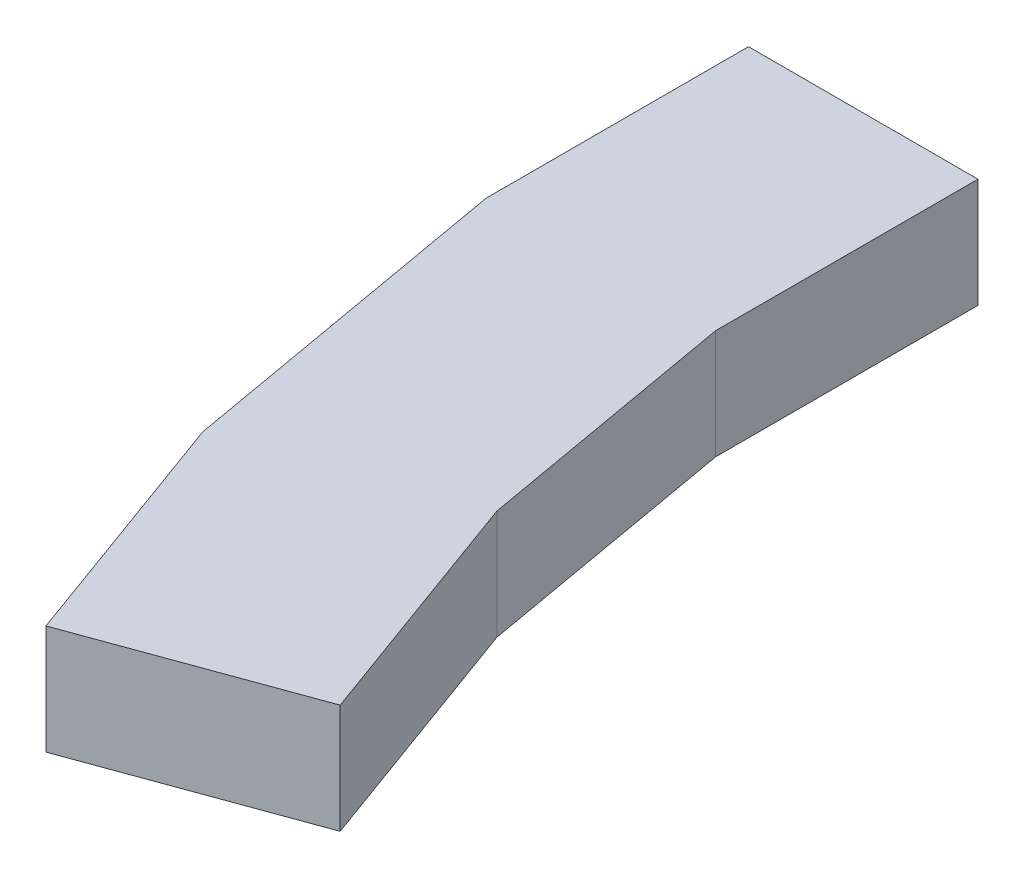
ISO-10303-21;
HEADER;
FILE_DESCRIPTION(('STEP AP214'),'2;1');
FILE_NAME('part.step','',(''),(''),'','','');
FILE_SCHEMA(('AUTOMOTIVE_DESIGN { 1 0 10303 214 1 1 1 1 }'));
ENDSEC;
DATA;
#1=APPLICATION_CONTEXT('core data for automotive mechanical design processes');
#2=APPLICATION_PROTOCOL_DEFINITION('international standard','automotive_design',2000,#1);
#3=PRODUCT_CONTEXT('',#1,'mechanical');
#4=PRODUCT('Part','Part','',(#3));
#5=PRODUCT_RELATED_PRODUCT_CATEGORY('part','',(#4));
#6=PRODUCT_DEFINITION_FORMATION('','',#4);
#7=PRODUCT_DEFINITION_CONTEXT('part definition',#1,'design');
#8=PRODUCT_DEFINITION('design','',#6,#7);
#9=PRODUCT_DEFINITION_SHAPE('','',#8);
#10=(LENGTH_UNIT() NAMED_UNIT(*) SI_UNIT(.MILLI.,.METRE.));
#11=(NAMED_UNIT(*) PLANE_ANGLE_UNIT() SI_UNIT($,.RADIAN.));
#12=(NAMED_UNIT(*) SI_UNIT($,.STERADIAN.) SOLID_ANGLE_UNIT());
#13=UNCERTAINTY_MEASURE_WITH_UNIT(LENGTH_MEASURE(1.E-05),#10,'distance_accuracy_value','');
#14=(GEOMETRIC_REPRESENTATION_CONTEXT(3) GLOBAL_UNCERTAINTY_ASSIGNED_CONTEXT((#13)) GLOBAL_UNIT_ASSIGNED_CONTEXT((#10,
#11,#12)) REPRESENTATION_CONTEXT('',''));
#15=CARTESIAN_POINT('',(0.,0.,0.));
#16=DIRECTION('',(0.,0.,1.));
#17=DIRECTION('',(1.,0.,0.));
#18=AXIS2_PLACEMENT_3D('',#15,#16,#17);
#19=CARTESIAN_POINT('',(37.1122382547684,86.0424365132959,-36.5000000372529));
#20=DIRECTION('',(1.,0.,0.));
#21=DIRECTION('',(0.,1.,0.));
#22=AXIS2_PLACEMENT_3D('',#19,#20,#21);
#23=PLANE('',#22);
#24=DIRECTION('',(0.,0.,1.));
#25=VECTOR('',#24,1.);
#26=CARTESIAN_POINT('',(37.1122382547684,76.0424365132959,-36.5000000372529));
#27=LINE('',#26,#25);
#28=CARTESIAN_POINT('',(37.1122382547684,76.0424365132959,-36.5000000372529));
#29=VERTEX_POINT('',#28);
#30=CARTESIAN_POINT('',(37.1122382547684,76.0424365132959,-12.5000000745058));
#31=VERTEX_POINT('',#30);
#32=EDGE_CURVE('E129',#29,#31,#27,.T.);
#33=ORIENTED_EDGE('',*,*,#32,.T.);
#34=DIRECTION('',(0.,-1.,0.));
#35=VECTOR('',#34,1.);
#36=CARTESIAN_POINT('',(37.1122382547684,86.0424365132959,-12.5000000745058));
#37=LINE('',#36,#35);
#38=CARTESIAN_POINT('',(37.1122382547684,86.0424365132959,-12.5000000745058));
#39=VERTEX_POINT('',#38);
#40=EDGE_CURVE('E11',#39,#31,#37,.T.);
#41=ORIENTED_EDGE('',*,*,#40,.F.);
#42=DIRECTION('',(0.,0.,1.));
#43=VECTOR('',#42,1.);
#44=CARTESIAN_POINT('',(37.1122382547684,86.0424365132959,-36.5000000372529));
#45=LINE('',#44,#43);
#46=CARTESIAN_POINT('',(37.1122382547684,86.0424365132959,-36.5000000372529));
#47=VERTEX_POINT('',#46);
#48=EDGE_CURVE('E143',#47,#39,#45,.T.);
#49=ORIENTED_EDGE('',*,*,#48,.F.);
#50=DIRECTION('',(0.,-1.,0.));
#51=VECTOR('',#50,1.);
#52=CARTESIAN_POINT('',(37.1122382547684,86.0424365132959,-36.5000000372529));
#53=LINE('',#52,#51);
#54=EDGE_CURVE('E125',#47,#29,#53,.T.);
#55=ORIENTED_EDGE('',*,*,#54,.T.);
#56=EDGE_LOOP('',(#33,#41,#49,#55));
#57=FACE_BOUND('',#56,.T.);
#58=ADVANCED_FACE('F33',(#57),#23,.F.);
#59=CARTESIAN_POINT('',(37.1122382547684,86.0424365132959,-12.5000000745058));
#60=DIRECTION('',(0.984807753012208,0.,-0.173648177666931));
#61=DIRECTION('',(-0.173648177666931,0.,-0.984807753012208));
#62=AXIS2_PLACEMENT_3D('',#59,#60,#61);
#63=PLANE('',#62);
#64=DIRECTION('',(0.173648177666931,0.,0.984807753012208));
#65=VECTOR('',#64,1.);
#66=CARTESIAN_POINT('',(37.1122382547684,76.0424365132959,-12.5000000745058));
#67=LINE('',#66,#65);
#68=CARTESIAN_POINT('',(42.6646920591521,76.0424365132959,18.9895302405625));
#69=VERTEX_POINT('',#68);
#70=EDGE_CURVE('E132',#31,#69,#67,.T.);
#71=ORIENTED_EDGE('',*,*,#70,.T.);
#72=DIRECTION('',(0.,-1.,0.));
#73=VECTOR('',#72,1.);
#74=CARTESIAN_POINT('',(42.6646920591521,86.0424365132959,18.9895302405625));
#75=LINE('',#74,#73);
#76=CARTESIAN_POINT('',(42.6646920591521,86.0424365132959,18.9895302405625));
#77=VERTEX_POINT('',#76);
#78=EDGE_CURVE('E41',#77,#69,#75,.T.);
#79=ORIENTED_EDGE('',*,*,#78,.F.);
#80=DIRECTION('',(0.173648177666931,0.,0.984807753012208));
#81=VECTOR('',#80,1.);
#82=CARTESIAN_POINT('',(37.1122382547684,86.0424365132959,-12.5000000745058));
#83=LINE('',#82,#81);
#84=EDGE_CURVE('E92',#39,#77,#83,.T.);
#85=ORIENTED_EDGE('',*,*,#84,.F.);
#86=ORIENTED_EDGE('',*,*,#40,.T.);
#87=EDGE_LOOP('',(#71,#79,#85,#86));
#88=FACE_BOUND('',#87,.T.);
#89=ADVANCED_FACE('F178',(#88),#63,.F.);
#90=CARTESIAN_POINT('',(42.6646920591521,86.0424365132959,18.9895302405625));
#91=DIRECTION('',(0.939692620785908,0.,-0.34202014332567));
#92=DIRECTION('',(-0.34202014332567,0.,-0.939692620785908));
#93=AXIS2_PLACEMENT_3D('',#90,#91,#92);
#94=PLANE('',#93);
#95=DIRECTION('',(0.34202014332567,0.,0.939692620785908));
#96=VECTOR('',#95,1.);
#97=CARTESIAN_POINT('',(42.6646920591521,76.0424365132959,18.9895302405625));
#98=LINE('',#97,#96);
#99=CARTESIAN_POINT('',(50.8731754862269,76.0424365132959,41.542153104418));
#100=VERTEX_POINT('',#99);
#101=EDGE_CURVE('E134',#69,#100,#98,.T.);
#102=ORIENTED_EDGE('',*,*,#101,.T.);
#103=DIRECTION('',(0.,-1.,0.));
#104=VECTOR('',#103,1.);
#105=CARTESIAN_POINT('',(50.8731754862269,86.0424365132959,41.542153104418));
#106=LINE('',#105,#104);
#107=CARTESIAN_POINT('',(50.8731754862269,86.0424365132959,41.542153104418));
#108=VERTEX_POINT('',#107);
#109=EDGE_CURVE('E150',#108,#100,#106,.T.);
#110=ORIENTED_EDGE('',*,*,#109,.F.);
#111=DIRECTION('',(0.34202014332567,0.,0.939692620785908));
#112=VECTOR('',#111,1.);
#113=CARTESIAN_POINT('',(42.6646920591521,86.0424365132959,18.9895302405625));
#114=LINE('',#113,#112);
#115=EDGE_CURVE('E158',#77,#108,#114,.T.);
#116=ORIENTED_EDGE('',*,*,#115,.F.);
#117=ORIENTED_EDGE('',*,*,#78,.T.);
#118=EDGE_LOOP('',(#102,#110,#116,#117));
#119=FACE_BOUND('',#118,.T.);
#120=ADVANCED_FACE('F156',(#119),#94,.F.);
#121=CARTESIAN_POINT('',(50.8731754862269,86.0424365132959,41.542153104418));
#122=DIRECTION('',(-0.34202014332567,0.,-0.939692620785908));
#123=DIRECTION('',(-0.939692620785908,0.,0.34202014332567));
#124=AXIS2_PLACEMENT_3D('',#121,#122,#123);
#125=PLANE('',#124);
#126=DIRECTION('',(0.939692620785908,0.,-0.34202014332567));
#127=VECTOR('',#126,1.);
#128=CARTESIAN_POINT('',(50.8731754862269,76.0424365132959,41.542153104418));
#129=LINE('',#128,#127);
#130=CARTESIAN_POINT('',(70.606720522731,76.0424365132959,34.3597300945789));
#131=VERTEX_POINT('',#130);
#132=EDGE_CURVE('E136',#100,#131,#129,.T.);
#133=ORIENTED_EDGE('',*,*,#132,.T.);
#134=DIRECTION('',(0.,-1.,0.));
#135=VECTOR('',#134,1.);
#136=CARTESIAN_POINT('',(70.606720522731,86.0424365132959,34.3597300945789));
#137=LINE('',#136,#135);
#138=CARTESIAN_POINT('',(70.606720522731,86.0424365132959,34.3597300945789));
#139=VERTEX_POINT('',#138);
#140=EDGE_CURVE('E147',#139,#131,#137,.T.);
#141=ORIENTED_EDGE('',*,*,#140,.F.);
#142=DIRECTION('',(0.939692620785908,0.,-0.34202014332567));
#143=VECTOR('',#142,1.);
#144=CARTESIAN_POINT('',(50.8731754862269,86.0424365132959,41.542153104418));
#145=LINE('',#144,#143);
#146=EDGE_CURVE('E170',#108,#139,#145,.T.);
#147=ORIENTED_EDGE('',*,*,#146,.F.);
#148=ORIENTED_EDGE('',*,*,#109,.T.);
#149=EDGE_LOOP('',(#133,#141,#147,#148));
#150=FACE_BOUND('',#149,.T.);
#151=ADVANCED_FACE('F166',(#150),#125,.F.);
#152=CARTESIAN_POINT('',(70.606720522731,86.0424365132959,34.3597300945789));
#153=DIRECTION('',(-0.939692620785908,0.,0.34202014332567));
#154=DIRECTION('',(0.34202014332567,0.,0.939692620785908));
#155=AXIS2_PLACEMENT_3D('',#152,#153,#154);
#156=PLANE('',#155);
#157=DIRECTION('',(-0.34202014332567,0.,-0.939692620785908));
#158=VECTOR('',#157,1.);
#159=CARTESIAN_POINT('',(70.606720522731,76.0424365132959,34.3597300945789));
#160=LINE('',#159,#158);
#161=CARTESIAN_POINT('',(62.3982370956562,76.0424365132959,11.8071072307234));
#162=VERTEX_POINT('',#161);
#163=EDGE_CURVE('E138',#131,#162,#160,.T.);
#164=ORIENTED_EDGE('',*,*,#163,.T.);
#165=DIRECTION('',(0.,-1.,0.));
#166=VECTOR('',#165,1.);
#167=CARTESIAN_POINT('',(62.3982370956562,86.0424365132959,11.8071072307234));
#168=LINE('',#167,#166);
#169=CARTESIAN_POINT('',(62.3982370956562,86.0424365132959,11.8071072307234));
#170=VERTEX_POINT('',#169);
#171=EDGE_CURVE('E120',#170,#162,#168,.T.);
#172=ORIENTED_EDGE('',*,*,#171,.F.);
#173=DIRECTION('',(-0.34202014332567,0.,-0.939692620785908));
#174=VECTOR('',#173,1.);
#175=CARTESIAN_POINT('',(70.606720522731,86.0424365132959,34.3597300945789));
#176=LINE('',#175,#174);
#177=EDGE_CURVE('E111',#139,#170,#176,.T.);
#178=ORIENTED_EDGE('',*,*,#177,.F.);
#179=ORIENTED_EDGE('',*,*,#140,.T.);
#180=EDGE_LOOP('',(#164,#172,#178,#179));
#181=FACE_BOUND('',#180,.T.);
#182=ADVANCED_FACE('F169',(#181),#156,.F.);
#183=CARTESIAN_POINT('',(62.3982370956562,86.0424365132959,11.8071072307234));
#184=DIRECTION('',(-0.984807753012208,0.,0.173648177666931));
#185=DIRECTION('',(0.173648177666931,0.,0.984807753012208));
#186=AXIS2_PLACEMENT_3D('',#183,#184,#185);
#187=PLANE('',#186);
#188=DIRECTION('',(-0.173648177666931,0.,-0.984807753012208));
#189=VECTOR('',#188,1.);
#190=CARTESIAN_POINT('',(62.3982370956562,76.0424365132959,11.8071072307234));
#191=LINE('',#190,#189);
#192=CARTESIAN_POINT('',(58.1122382547684,76.0424365132959,-12.5000000745058));
#193=VERTEX_POINT('',#192);
#194=EDGE_CURVE('E119',#162,#193,#191,.T.);
#195=ORIENTED_EDGE('',*,*,#194,.T.);
#196=DIRECTION('',(0.,-1.,0.));
#197=VECTOR('',#196,1.);
#198=CARTESIAN_POINT('',(58.1122382547684,86.0424365132959,-12.5000000745058));
#199=LINE('',#198,#197);
#200=CARTESIAN_POINT('',(58.1122382547684,86.0424365132959,-12.5000000745058));
#201=VERTEX_POINT('',#200);
#202=EDGE_CURVE('E116',#201,#193,#199,.T.);
#203=ORIENTED_EDGE('',*,*,#202,.F.);
#204=DIRECTION('',(-0.173648177666931,0.,-0.984807753012208));
#205=VECTOR('',#204,1.);
#206=CARTESIAN_POINT('',(62.3982370956562,86.0424365132959,11.8071072307234));
#207=LINE('',#206,#205);
#208=EDGE_CURVE('E105',#170,#201,#207,.T.);
#209=ORIENTED_EDGE('',*,*,#208,.F.);
#210=ORIENTED_EDGE('',*,*,#171,.T.);
#211=EDGE_LOOP('',(#195,#203,#209,#210));
#212=FACE_BOUND('',#211,.T.);
#213=ADVANCED_FACE('F117',(#212),#187,.F.);
#214=CARTESIAN_POINT('',(58.1122382547684,86.0424365132959,-12.5000000745058));
#215=DIRECTION('',(-1.,0.,0.));
#216=DIRECTION('',(0.,-1.,0.));
#217=AXIS2_PLACEMENT_3D('',#214,#215,#216);
#218=PLANE('',#217);
#219=DIRECTION('',(0.,0.,-1.));
#220=VECTOR('',#219,1.);
#221=CARTESIAN_POINT('',(58.1122382547684,76.0424365132959,-12.5000000745058));
#222=LINE('',#221,#220);
#223=CARTESIAN_POINT('',(58.1122382547684,76.0424365132959,-36.5000000372529));
#224=VERTEX_POINT('',#223);
#225=EDGE_CURVE('E78',#193,#224,#222,.T.);
#226=ORIENTED_EDGE('',*,*,#225,.T.);
#227=DIRECTION('',(0.,-1.,0.));
#228=VECTOR('',#227,1.);
#229=CARTESIAN_POINT('',(58.1122382547684,86.0424365132959,-36.5000000372529));
#230=LINE('',#229,#228);
#231=CARTESIAN_POINT('',(58.1122382547684,86.0424365132959,-36.5000000372529));
#232=VERTEX_POINT('',#231);
#233=EDGE_CURVE('E121',#232,#224,#230,.T.);
#234=ORIENTED_EDGE('',*,*,#233,.F.);
#235=DIRECTION('',(0.,0.,-1.));
#236=VECTOR('',#235,1.);
#237=CARTESIAN_POINT('',(58.1122382547684,86.0424365132959,-12.5000000745058));
#238=LINE('',#237,#236);
#239=EDGE_CURVE('E109',#201,#232,#238,.T.);
#240=ORIENTED_EDGE('',*,*,#239,.F.);
#241=ORIENTED_EDGE('',*,*,#202,.T.);
#242=EDGE_LOOP('',(#226,#234,#240,#241));
#243=FACE_BOUND('',#242,.T.);
#244=ADVANCED_FACE('F123',(#243),#218,.F.);
#245=CARTESIAN_POINT('',(58.1122382547684,86.0424365132959,-36.5000000372529));
#246=DIRECTION('',(0.,0.,1.));
#247=DIRECTION('',(1.,0.,0.));
#248=AXIS2_PLACEMENT_3D('',#245,#246,#247);
#249=PLANE('',#248);
#250=DIRECTION('',(-1.,0.,0.));
#251=VECTOR('',#250,1.);
#252=CARTESIAN_POINT('',(58.1122382547684,76.0424365132959,-36.5000000372529));
#253=LINE('',#252,#251);
#254=EDGE_CURVE('E84',#224,#29,#253,.T.);
#255=ORIENTED_EDGE('',*,*,#254,.T.);
#256=ORIENTED_EDGE('',*,*,#54,.F.);
#257=DIRECTION('',(-1.,0.,0.));
#258=VECTOR('',#257,1.);
#259=CARTESIAN_POINT('',(58.1122382547684,86.0424365132959,-36.5000000372529));
#260=LINE('',#259,#258);
#261=EDGE_CURVE('E49',#232,#47,#260,.T.);
#262=ORIENTED_EDGE('',*,*,#261,.F.);
#263=ORIENTED_EDGE('',*,*,#233,.T.);
#264=EDGE_LOOP('',(#255,#256,#262,#263));
#265=FACE_BOUND('',#264,.T.);
#266=ADVANCED_FACE('F194',(#265),#249,.F.);
#267=CARTESIAN_POINT('',(0.,86.0424365132958,0.));
#268=DIRECTION('',(0.,-1.,0.));
#269=DIRECTION('',(1.,0.,0.));
#270=AXIS2_PLACEMENT_3D('',#267,#268,#269);
#271=PLANE('',#270);
#272=ORIENTED_EDGE('',*,*,#48,.T.);
#273=ORIENTED_EDGE('',*,*,#84,.T.);
#274=ORIENTED_EDGE('',*,*,#115,.T.);
#275=ORIENTED_EDGE('',*,*,#146,.T.);
#276=ORIENTED_EDGE('',*,*,#177,.T.);
#277=ORIENTED_EDGE('',*,*,#208,.T.);
#278=ORIENTED_EDGE('',*,*,#239,.T.);
#279=ORIENTED_EDGE('',*,*,#261,.T.);
#280=EDGE_LOOP('',(#272,#273,#274,#275,#276,#277,#278,#279));
#281=FACE_BOUND('',#280,.T.);
#282=ADVANCED_FACE('F107',(#281),#271,.F.);
#283=CARTESIAN_POINT('',(0.,76.0424365132958,0.));
#284=DIRECTION('',(0.,-1.,0.));
#285=DIRECTION('',(1.,0.,0.));
#286=AXIS2_PLACEMENT_3D('',#283,#284,#285);
#287=PLANE('',#286);
#288=ORIENTED_EDGE('',*,*,#32,.F.);
#289=ORIENTED_EDGE('',*,*,#254,.F.);
#290=ORIENTED_EDGE('',*,*,#225,.F.);
#291=ORIENTED_EDGE('',*,*,#194,.F.);
#292=ORIENTED_EDGE('',*,*,#163,.F.);
#293=ORIENTED_EDGE('',*,*,#132,.F.);
#294=ORIENTED_EDGE('',*,*,#101,.F.);
#295=ORIENTED_EDGE('',*,*,#70,.F.);
#296=EDGE_LOOP('',(#288,#289,#290,#291,#292,#293,#294,#295));
#297=FACE_BOUND('',#296,.T.);
#298=ADVANCED_FACE('F162',(#297),#287,.T.);
#299=CLOSED_SHELL('',(#58,#89,#120,#151,#182,#213,#244,#266,#282,#298));
#300=MANIFOLD_SOLID_BREP('B2',#299);
#301=ADVANCED_BREP_SHAPE_REPRESENTATION('',(#18,#300),#14);
#302=SHAPE_DEFINITION_REPRESENTATION(#9,#301);
ENDSEC;
END-ISO-10303-21;
